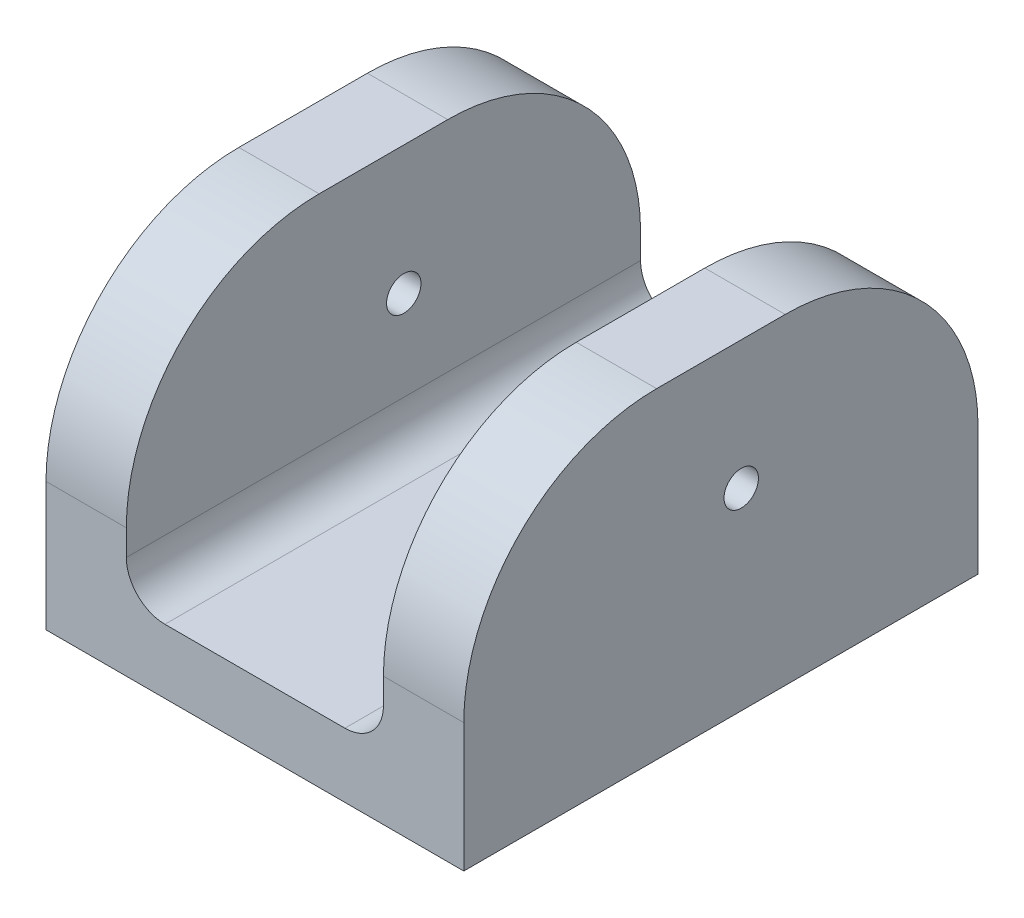
ISO-10303-21;
HEADER;
FILE_DESCRIPTION(('STEP AP214'),'2;1');
FILE_NAME('part.step','',(''),(''),'','','');
FILE_SCHEMA(('AUTOMOTIVE_DESIGN { 1 0 10303 214 1 1 1 1 }'));
ENDSEC;
DATA;
#1=APPLICATION_CONTEXT('core data for automotive mechanical design processes');
#2=APPLICATION_PROTOCOL_DEFINITION('international standard','automotive_design',2000,#1);
#3=PRODUCT_CONTEXT('',#1,'mechanical');
#4=PRODUCT('Part','Part','',(#3));
#5=PRODUCT_RELATED_PRODUCT_CATEGORY('part','',(#4));
#6=PRODUCT_DEFINITION_FORMATION('','',#4);
#7=PRODUCT_DEFINITION_CONTEXT('part definition',#1,'design');
#8=PRODUCT_DEFINITION('design','',#6,#7);
#9=PRODUCT_DEFINITION_SHAPE('','',#8);
#10=(LENGTH_UNIT() NAMED_UNIT(*) SI_UNIT(.MILLI.,.METRE.));
#11=(NAMED_UNIT(*) PLANE_ANGLE_UNIT() SI_UNIT($,.RADIAN.));
#12=(NAMED_UNIT(*) SI_UNIT($,.STERADIAN.) SOLID_ANGLE_UNIT());
#13=UNCERTAINTY_MEASURE_WITH_UNIT(LENGTH_MEASURE(1.E-05),#10,'distance_accuracy_value','');
#14=(GEOMETRIC_REPRESENTATION_CONTEXT(3) GLOBAL_UNCERTAINTY_ASSIGNED_CONTEXT((#13)) GLOBAL_UNIT_ASSIGNED_CONTEXT((#10,
#11,#12)) REPRESENTATION_CONTEXT('',''));
#15=CARTESIAN_POINT('',(0.,0.,0.));
#16=DIRECTION('',(0.,0.,1.));
#17=DIRECTION('',(1.,0.,0.));
#18=AXIS2_PLACEMENT_3D('',#15,#16,#17);
#19=CARTESIAN_POINT('',(20.6375,6.35000000000001,50.8));
#20=DIRECTION('',(-1.,0.,0.));
#21=DIRECTION('',(0.,0.,1.));
#22=AXIS2_PLACEMENT_3D('',#19,#20,#21);
#23=PLANE('',#22);
#24=CARTESIAN_POINT('',(20.6375,19.05,23.3910868668556));
#25=DIRECTION('',(1.,0.,0.));
#26=DIRECTION('',(0.,0.,-1.));
#27=AXIS2_PLACEMENT_3D('',#24,#25,#26);
#28=CIRCLE('',#27,1.69999999999999);
#29=CARTESIAN_POINT('',(20.6375,19.05,21.6910868668556));
#30=VERTEX_POINT('',#29);
#31=EDGE_CURVE('E392',#30,#30,#28,.T.);
#32=ORIENTED_EDGE('',*,*,#31,.F.);
#33=EDGE_LOOP('',(#32));
#34=FACE_BOUND('',#33,.T.);
#35=DIRECTION('',(0.,0.,-1.));
#36=VECTOR('',#35,1.);
#37=CARTESIAN_POINT('',(20.6375,31.75,50.8));
#38=LINE('',#37,#36);
#39=CARTESIAN_POINT('',(20.6375,31.75,31.75));
#40=VERTEX_POINT('',#39);
#41=CARTESIAN_POINT('',(20.6375,31.75,19.05));
#42=VERTEX_POINT('',#41);
#43=EDGE_CURVE('E230',#40,#42,#38,.T.);
#44=ORIENTED_EDGE('',*,*,#43,.F.);
#45=CARTESIAN_POINT('',(20.6375,12.7,31.75));
#46=DIRECTION('',(-1.,0.,0.));
#47=DIRECTION('',(0.,0.,1.));
#48=AXIS2_PLACEMENT_3D('',#45,#46,#47);
#49=CIRCLE('',#48,19.05);
#50=CARTESIAN_POINT('',(20.6375,12.7,50.8));
#51=VERTEX_POINT('',#50);
#52=EDGE_CURVE('E264',#40,#51,#49,.F.);
#53=ORIENTED_EDGE('',*,*,#52,.T.);
#54=DIRECTION('',(0.,1.,0.));
#55=VECTOR('',#54,1.);
#56=CARTESIAN_POINT('',(20.6375,0.,50.8));
#57=LINE('',#56,#55);
#58=CARTESIAN_POINT('',(20.6375,0.,50.8));
#59=VERTEX_POINT('',#58);
#60=EDGE_CURVE('E186',#59,#51,#57,.T.);
#61=ORIENTED_EDGE('',*,*,#60,.F.);
#62=DIRECTION('',(0.,0.,-1.));
#63=VECTOR('',#62,1.);
#64=CARTESIAN_POINT('',(20.6375,0.,50.8));
#65=LINE('',#64,#63);
#66=CARTESIAN_POINT('',(20.6375,0.,0.));
#67=VERTEX_POINT('',#66);
#68=EDGE_CURVE('E201',#59,#67,#65,.T.);
#69=ORIENTED_EDGE('',*,*,#68,.T.);
#70=DIRECTION('',(0.,1.,0.));
#71=VECTOR('',#70,1.);
#72=CARTESIAN_POINT('',(20.6375,6.35000000000001,0.));
#73=LINE('',#72,#71);
#74=CARTESIAN_POINT('',(20.6375,12.7,0.));
#75=VERTEX_POINT('',#74);
#76=EDGE_CURVE('E185',#67,#75,#73,.T.);
#77=ORIENTED_EDGE('',*,*,#76,.T.);
#78=CARTESIAN_POINT('',(20.6375,12.7,19.05));
#79=DIRECTION('',(-1.,0.,0.));
#80=DIRECTION('',(0.,0.,1.));
#81=AXIS2_PLACEMENT_3D('',#78,#79,#80);
#82=CIRCLE('',#81,19.05);
#83=EDGE_CURVE('E262',#75,#42,#82,.F.);
#84=ORIENTED_EDGE('',*,*,#83,.T.);
#85=EDGE_LOOP('',(#44,#53,#61,#69,#77,#84));
#86=FACE_BOUND('',#85,.T.);
#87=ADVANCED_FACE('F39',(#34,#86),#23,.F.);
#88=CARTESIAN_POINT('',(20.6375,31.75,50.8));
#89=DIRECTION('',(0.,-1.,0.));
#90=DIRECTION('',(1.,0.,0.));
#91=AXIS2_PLACEMENT_3D('',#88,#89,#90);
#92=PLANE('',#91);
#93=DIRECTION('',(0.,0.,-1.));
#94=VECTOR('',#93,1.);
#95=CARTESIAN_POINT('',(12.7,31.75,50.8));
#96=LINE('',#95,#94);
#97=CARTESIAN_POINT('',(12.7,31.75,31.75));
#98=VERTEX_POINT('',#97);
#99=CARTESIAN_POINT('',(12.7,31.75,19.05));
#100=VERTEX_POINT('',#99);
#101=EDGE_CURVE('E227',#98,#100,#96,.T.);
#102=ORIENTED_EDGE('',*,*,#101,.F.);
#103=DIRECTION('',(-1.,0.,0.));
#104=VECTOR('',#103,1.);
#105=CARTESIAN_POINT('',(20.6375,31.75,31.75));
#106=LINE('',#105,#104);
#107=EDGE_CURVE('E260',#98,#40,#106,.F.);
#108=ORIENTED_EDGE('',*,*,#107,.T.);
#109=ORIENTED_EDGE('',*,*,#43,.T.);
#110=DIRECTION('',(-1.,0.,0.));
#111=VECTOR('',#110,1.);
#112=CARTESIAN_POINT('',(20.6375,31.75,19.05));
#113=LINE('',#112,#111);
#114=EDGE_CURVE('E257',#42,#100,#113,.T.);
#115=ORIENTED_EDGE('',*,*,#114,.T.);
#116=EDGE_LOOP('',(#102,#108,#109,#115));
#117=FACE_BOUND('',#116,.T.);
#118=ADVANCED_FACE('F322',(#117),#92,.F.);
#119=CARTESIAN_POINT('',(12.7,31.75,50.8));
#120=DIRECTION('',(1.,0.,0.));
#121=DIRECTION('',(0.,0.,-1.));
#122=AXIS2_PLACEMENT_3D('',#119,#120,#121);
#123=PLANE('',#122);
#124=CARTESIAN_POINT('',(12.7,19.05,23.3910868668556));
#125=DIRECTION('',(1.,0.,0.));
#126=DIRECTION('',(0.,0.,-1.));
#127=AXIS2_PLACEMENT_3D('',#124,#125,#126);
#128=CIRCLE('',#127,1.69999999999999);
#129=CARTESIAN_POINT('',(12.7,19.05,21.6910868668556));
#130=VERTEX_POINT('',#129);
#131=EDGE_CURVE('E167',#130,#130,#128,.T.);
#132=ORIENTED_EDGE('',*,*,#131,.T.);
#133=EDGE_LOOP('',(#132));
#134=FACE_BOUND('',#133,.T.);
#135=DIRECTION('',(0.,-1.,0.));
#136=VECTOR('',#135,1.);
#137=CARTESIAN_POINT('',(12.7,31.75,0.));
#138=LINE('',#137,#136);
#139=CARTESIAN_POINT('',(12.7,12.7,0.));
#140=VERTEX_POINT('',#139);
#141=CARTESIAN_POINT('',(12.7,10.16,0.));
#142=VERTEX_POINT('',#141);
#143=EDGE_CURVE('E204',#140,#142,#138,.T.);
#144=ORIENTED_EDGE('',*,*,#143,.T.);
#145=DIRECTION('',(0.,0.,-1.));
#146=VECTOR('',#145,1.);
#147=CARTESIAN_POINT('',(12.7,10.16,50.8));
#148=LINE('',#147,#146);
#149=CARTESIAN_POINT('',(12.7,10.16,50.8));
#150=VERTEX_POINT('',#149);
#151=EDGE_CURVE('E276',#142,#150,#148,.F.);
#152=ORIENTED_EDGE('',*,*,#151,.T.);
#153=DIRECTION('',(0.,-1.,0.));
#154=VECTOR('',#153,1.);
#155=CARTESIAN_POINT('',(12.7,31.75,50.8));
#156=LINE('',#155,#154);
#157=CARTESIAN_POINT('',(12.7,12.7,50.8));
#158=VERTEX_POINT('',#157);
#159=EDGE_CURVE('E189',#158,#150,#156,.T.);
#160=ORIENTED_EDGE('',*,*,#159,.F.);
#161=CARTESIAN_POINT('',(12.7,12.7,31.75));
#162=DIRECTION('',(1.,0.,0.));
#163=DIRECTION('',(0.,0.,-1.));
#164=AXIS2_PLACEMENT_3D('',#161,#162,#163);
#165=CIRCLE('',#164,19.05);
#166=EDGE_CURVE('E255',#158,#98,#165,.F.);
#167=ORIENTED_EDGE('',*,*,#166,.T.);
#168=ORIENTED_EDGE('',*,*,#101,.T.);
#169=CARTESIAN_POINT('',(12.7,12.7,19.05));
#170=DIRECTION('',(1.,0.,0.));
#171=DIRECTION('',(0.,0.,-1.));
#172=AXIS2_PLACEMENT_3D('',#169,#170,#171);
#173=CIRCLE('',#172,19.05);
#174=EDGE_CURVE('E253',#100,#140,#173,.F.);
#175=ORIENTED_EDGE('',*,*,#174,.T.);
#176=EDGE_LOOP('',(#144,#152,#160,#167,#168,#175));
#177=FACE_BOUND('',#176,.T.);
#178=ADVANCED_FACE('F320',(#134,#177),#123,.F.);
#179=CARTESIAN_POINT('',(12.7,6.35000000000001,50.8));
#180=DIRECTION('',(0.,-1.,0.));
#181=DIRECTION('',(1.,0.,0.));
#182=AXIS2_PLACEMENT_3D('',#179,#180,#181);
#183=PLANE('',#182);
#184=DIRECTION('',(-1.,0.,0.));
#185=VECTOR('',#184,1.);
#186=CARTESIAN_POINT('',(12.7,6.35000000000001,50.8));
#187=LINE('',#186,#185);
#188=CARTESIAN_POINT('',(8.89,6.35000000000001,50.8));
#189=VERTEX_POINT('',#188);
#190=CARTESIAN_POINT('',(-8.89,6.35,50.8));
#191=VERTEX_POINT('',#190);
#192=EDGE_CURVE('E193',#189,#191,#187,.T.);
#193=ORIENTED_EDGE('',*,*,#192,.F.);
#194=DIRECTION('',(0.,0.,-1.));
#195=VECTOR('',#194,1.);
#196=CARTESIAN_POINT('',(8.89,6.35000000000001,0.));
#197=LINE('',#196,#195);
#198=CARTESIAN_POINT('',(8.89,6.35000000000001,0.));
#199=VERTEX_POINT('',#198);
#200=EDGE_CURVE('E273',#189,#199,#197,.T.);
#201=ORIENTED_EDGE('',*,*,#200,.T.);
#202=DIRECTION('',(-1.,0.,0.));
#203=VECTOR('',#202,1.);
#204=CARTESIAN_POINT('',(12.7,6.35000000000001,0.));
#205=LINE('',#204,#203);
#206=CARTESIAN_POINT('',(-8.89,6.35,0.));
#207=VERTEX_POINT('',#206);
#208=EDGE_CURVE('E207',#199,#207,#205,.T.);
#209=ORIENTED_EDGE('',*,*,#208,.T.);
#210=DIRECTION('',(0.,0.,-1.));
#211=VECTOR('',#210,1.);
#212=CARTESIAN_POINT('',(-8.89,6.35,50.8));
#213=LINE('',#212,#211);
#214=EDGE_CURVE('E271',#207,#191,#213,.F.);
#215=ORIENTED_EDGE('',*,*,#214,.T.);
#216=EDGE_LOOP('',(#193,#201,#209,#215));
#217=FACE_BOUND('',#216,.T.);
#218=ADVANCED_FACE('F291',(#217),#183,.F.);
#219=CARTESIAN_POINT('',(-12.7,31.75,50.8));
#220=DIRECTION('',(-1.,0.,0.));
#221=DIRECTION('',(0.,-1.,0.));
#222=AXIS2_PLACEMENT_3D('',#219,#220,#221);
#223=PLANE('',#222);
#224=CARTESIAN_POINT('',(-12.7,19.05,23.3910868668556));
#225=DIRECTION('',(-1.,0.,0.));
#226=DIRECTION('',(0.,-1.,0.));
#227=AXIS2_PLACEMENT_3D('',#224,#225,#226);
#228=CIRCLE('',#227,1.69999999999999);
#229=CARTESIAN_POINT('',(-12.7,17.35,23.3910868668556));
#230=VERTEX_POINT('',#229);
#231=EDGE_CURVE('E43',#230,#230,#228,.T.);
#232=ORIENTED_EDGE('',*,*,#231,.T.);
#233=EDGE_LOOP('',(#232));
#234=FACE_BOUND('',#233,.T.);
#235=DIRECTION('',(0.,1.,0.));
#236=VECTOR('',#235,1.);
#237=CARTESIAN_POINT('',(-12.7,31.75,50.8));
#238=LINE('',#237,#236);
#239=CARTESIAN_POINT('',(-12.7,10.16,50.8));
#240=VERTEX_POINT('',#239);
#241=CARTESIAN_POINT('',(-12.7,12.7,50.8));
#242=VERTEX_POINT('',#241);
#243=EDGE_CURVE('E195',#240,#242,#238,.T.);
#244=ORIENTED_EDGE('',*,*,#243,.F.);
#245=DIRECTION('',(0.,0.,-1.));
#246=VECTOR('',#245,1.);
#247=CARTESIAN_POINT('',(-12.7,10.16,0.));
#248=LINE('',#247,#246);
#249=CARTESIAN_POINT('',(-12.7,10.16,0.));
#250=VERTEX_POINT('',#249);
#251=EDGE_CURVE('E278',#240,#250,#248,.T.);
#252=ORIENTED_EDGE('',*,*,#251,.T.);
#253=DIRECTION('',(0.,1.,0.));
#254=VECTOR('',#253,1.);
#255=CARTESIAN_POINT('',(-12.7,31.75,0.));
#256=LINE('',#255,#254);
#257=CARTESIAN_POINT('',(-12.7,12.7,0.));
#258=VERTEX_POINT('',#257);
#259=EDGE_CURVE('E210',#250,#258,#256,.T.);
#260=ORIENTED_EDGE('',*,*,#259,.T.);
#261=CARTESIAN_POINT('',(-12.7,12.7,19.05));
#262=DIRECTION('',(-1.,0.,0.));
#263=DIRECTION('',(0.,-1.,0.));
#264=AXIS2_PLACEMENT_3D('',#261,#262,#263);
#265=CIRCLE('',#264,19.05);
#266=CARTESIAN_POINT('',(-12.7,31.75,19.05));
#267=VERTEX_POINT('',#266);
#268=EDGE_CURVE('E248',#258,#267,#265,.F.);
#269=ORIENTED_EDGE('',*,*,#268,.T.);
#270=DIRECTION('',(0.,0.,-1.));
#271=VECTOR('',#270,1.);
#272=CARTESIAN_POINT('',(-12.7,31.75,50.8));
#273=LINE('',#272,#271);
#274=CARTESIAN_POINT('',(-12.7,31.75,31.75));
#275=VERTEX_POINT('',#274);
#276=EDGE_CURVE('E224',#275,#267,#273,.T.);
#277=ORIENTED_EDGE('',*,*,#276,.F.);
#278=CARTESIAN_POINT('',(-12.7,12.7,31.75));
#279=DIRECTION('',(-1.,0.,0.));
#280=DIRECTION('',(0.,-1.,0.));
#281=AXIS2_PLACEMENT_3D('',#278,#279,#280);
#282=CIRCLE('',#281,19.05);
#283=EDGE_CURVE('E250',#275,#242,#282,.F.);
#284=ORIENTED_EDGE('',*,*,#283,.T.);
#285=EDGE_LOOP('',(#244,#252,#260,#269,#277,#284));
#286=FACE_BOUND('',#285,.T.);
#287=ADVANCED_FACE('F294',(#234,#286),#223,.F.);
#288=CARTESIAN_POINT('',(-20.6375,31.75,50.8));
#289=DIRECTION('',(0.,-1.,0.));
#290=DIRECTION('',(0.,0.,-1.));
#291=AXIS2_PLACEMENT_3D('',#288,#289,#290);
#292=PLANE('',#291);
#293=DIRECTION('',(0.,0.,-1.));
#294=VECTOR('',#293,1.);
#295=CARTESIAN_POINT('',(-20.6375,31.75,50.8));
#296=LINE('',#295,#294);
#297=CARTESIAN_POINT('',(-20.6375,31.75,31.75));
#298=VERTEX_POINT('',#297);
#299=CARTESIAN_POINT('',(-20.6375,31.75,19.05));
#300=VERTEX_POINT('',#299);
#301=EDGE_CURVE('E221',#298,#300,#296,.T.);
#302=ORIENTED_EDGE('',*,*,#301,.F.);
#303=DIRECTION('',(-1.,0.,0.));
#304=VECTOR('',#303,1.);
#305=CARTESIAN_POINT('',(-12.7,31.75,31.75));
#306=LINE('',#305,#304);
#307=EDGE_CURVE('E246',#298,#275,#306,.F.);
#308=ORIENTED_EDGE('',*,*,#307,.T.);
#309=ORIENTED_EDGE('',*,*,#276,.T.);
#310=DIRECTION('',(-1.,0.,0.));
#311=VECTOR('',#310,1.);
#312=CARTESIAN_POINT('',(-20.6375,31.75,19.05));
#313=LINE('',#312,#311);
#314=EDGE_CURVE('E243',#267,#300,#313,.T.);
#315=ORIENTED_EDGE('',*,*,#314,.T.);
#316=EDGE_LOOP('',(#302,#308,#309,#315));
#317=FACE_BOUND('',#316,.T.);
#318=ADVANCED_FACE('F365',(#317),#292,.F.);
#319=CARTESIAN_POINT('',(-20.6375,0.,50.8));
#320=DIRECTION('',(1.,0.,0.));
#321=DIRECTION('',(0.,0.,-1.));
#322=AXIS2_PLACEMENT_3D('',#319,#320,#321);
#323=PLANE('',#322);
#324=CARTESIAN_POINT('',(-20.6375,19.05,23.3910868668556));
#325=DIRECTION('',(1.,0.,0.));
#326=DIRECTION('',(0.,0.,-1.));
#327=AXIS2_PLACEMENT_3D('',#324,#325,#326);
#328=CIRCLE('',#327,1.69999999999999);
#329=CARTESIAN_POINT('',(-20.6375,19.05,21.6910868668556));
#330=VERTEX_POINT('',#329);
#331=EDGE_CURVE('E388',#330,#330,#328,.T.);
#332=ORIENTED_EDGE('',*,*,#331,.T.);
#333=EDGE_LOOP('',(#332));
#334=FACE_BOUND('',#333,.T.);
#335=DIRECTION('',(0.,-1.,0.));
#336=VECTOR('',#335,1.);
#337=CARTESIAN_POINT('',(-20.6375,6.35000000000001,50.8));
#338=LINE('',#337,#336);
#339=CARTESIAN_POINT('',(-20.6375,12.7,50.8));
#340=VERTEX_POINT('',#339);
#341=CARTESIAN_POINT('',(-20.6375,0.,50.8));
#342=VERTEX_POINT('',#341);
#343=EDGE_CURVE('E197',#340,#342,#338,.T.);
#344=ORIENTED_EDGE('',*,*,#343,.F.);
#345=CARTESIAN_POINT('',(-20.6375,12.7,31.75));
#346=DIRECTION('',(1.,0.,0.));
#347=DIRECTION('',(0.,0.,-1.));
#348=AXIS2_PLACEMENT_3D('',#345,#346,#347);
#349=CIRCLE('',#348,19.05);
#350=EDGE_CURVE('E241',#340,#298,#349,.F.);
#351=ORIENTED_EDGE('',*,*,#350,.T.);
#352=ORIENTED_EDGE('',*,*,#301,.T.);
#353=CARTESIAN_POINT('',(-20.6375,12.7,19.05));
#354=DIRECTION('',(1.,0.,0.));
#355=DIRECTION('',(0.,0.,-1.));
#356=AXIS2_PLACEMENT_3D('',#353,#354,#355);
#357=CIRCLE('',#356,19.05);
#358=CARTESIAN_POINT('',(-20.6375,12.7,0.));
#359=VERTEX_POINT('',#358);
#360=EDGE_CURVE('E239',#300,#359,#357,.F.);
#361=ORIENTED_EDGE('',*,*,#360,.T.);
#362=DIRECTION('',(0.,-1.,0.));
#363=VECTOR('',#362,1.);
#364=CARTESIAN_POINT('',(-20.6375,0.,0.));
#365=LINE('',#364,#363);
#366=CARTESIAN_POINT('',(-20.6375,0.,0.));
#367=VERTEX_POINT('',#366);
#368=EDGE_CURVE('E212',#359,#367,#365,.T.);
#369=ORIENTED_EDGE('',*,*,#368,.T.);
#370=DIRECTION('',(0.,0.,-1.));
#371=VECTOR('',#370,1.);
#372=CARTESIAN_POINT('',(-20.6375,0.,50.8));
#373=LINE('',#372,#371);
#374=EDGE_CURVE('E218',#342,#367,#373,.T.);
#375=ORIENTED_EDGE('',*,*,#374,.F.);
#376=EDGE_LOOP('',(#344,#351,#352,#361,#369,#375));
#377=FACE_BOUND('',#376,.T.);
#378=ADVANCED_FACE('F303',(#334,#377),#323,.F.);
#379=CARTESIAN_POINT('',(-20.6375,0.,50.8));
#380=DIRECTION('',(0.,1.,0.));
#381=DIRECTION('',(-1.,0.,0.));
#382=AXIS2_PLACEMENT_3D('',#379,#380,#381);
#383=PLANE('',#382);
#384=CARTESIAN_POINT('',(16.66875,0.,3.96875));
#385=DIRECTION('',(0.,-1.,0.));
#386=DIRECTION('',(0.,0.,-1.));
#387=AXIS2_PLACEMENT_3D('',#384,#385,#386);
#388=CIRCLE('',#387,2.5527);
#389=CARTESIAN_POINT('',(16.66875,0.,1.41605000000001));
#390=VERTEX_POINT('',#389);
#391=EDGE_CURVE('E161',#390,#390,#388,.T.);
#392=ORIENTED_EDGE('',*,*,#391,.F.);
#393=EDGE_LOOP('',(#392));
#394=FACE_BOUND('',#393,.T.);
#395=CARTESIAN_POINT('',(-16.66875,0.,3.96875));
#396=DIRECTION('',(0.,-1.,0.));
#397=DIRECTION('',(0.,0.,-1.));
#398=AXIS2_PLACEMENT_3D('',#395,#396,#397);
#399=CIRCLE('',#398,2.5527);
#400=CARTESIAN_POINT('',(-16.66875,0.,1.41605));
#401=VERTEX_POINT('',#400);
#402=EDGE_CURVE('E160',#401,#401,#399,.T.);
#403=ORIENTED_EDGE('',*,*,#402,.F.);
#404=EDGE_LOOP('',(#403));
#405=FACE_BOUND('',#404,.T.);
#406=CARTESIAN_POINT('',(-16.66875,0.,46.83125));
#407=DIRECTION('',(0.,-1.,0.));
#408=DIRECTION('',(0.,0.,-1.));
#409=AXIS2_PLACEMENT_3D('',#406,#407,#408);
#410=CIRCLE('',#409,2.5527);
#411=CARTESIAN_POINT('',(-16.66875,0.,44.27855));
#412=VERTEX_POINT('',#411);
#413=EDGE_CURVE('E173',#412,#412,#410,.T.);
#414=ORIENTED_EDGE('',*,*,#413,.F.);
#415=EDGE_LOOP('',(#414));
#416=FACE_BOUND('',#415,.T.);
#417=CARTESIAN_POINT('',(16.66875,0.,46.83125));
#418=DIRECTION('',(0.,-1.,0.));
#419=DIRECTION('',(0.,0.,-1.));
#420=AXIS2_PLACEMENT_3D('',#417,#418,#419);
#421=CIRCLE('',#420,2.5527);
#422=CARTESIAN_POINT('',(16.66875,0.,44.27855));
#423=VERTEX_POINT('',#422);
#424=EDGE_CURVE('E179',#423,#423,#421,.T.);
#425=ORIENTED_EDGE('',*,*,#424,.F.);
#426=EDGE_LOOP('',(#425));
#427=FACE_BOUND('',#426,.T.);
#428=DIRECTION('',(1.,0.,0.));
#429=VECTOR('',#428,1.);
#430=CARTESIAN_POINT('',(-20.6375,0.,0.));
#431=LINE('',#430,#429);
#432=EDGE_CURVE('E190',#367,#67,#431,.T.);
#433=ORIENTED_EDGE('',*,*,#432,.T.);
#434=ORIENTED_EDGE('',*,*,#68,.F.);
#435=DIRECTION('',(1.,0.,0.));
#436=VECTOR('',#435,1.);
#437=CARTESIAN_POINT('',(-20.6375,0.,50.8));
#438=LINE('',#437,#436);
#439=EDGE_CURVE('E199',#342,#59,#438,.T.);
#440=ORIENTED_EDGE('',*,*,#439,.F.);
#441=ORIENTED_EDGE('',*,*,#374,.T.);
#442=EDGE_LOOP('',(#433,#434,#440,#441));
#443=FACE_BOUND('',#442,.T.);
#444=ADVANCED_FACE('F309',(#394,#405,#416,#427,#443),#383,.F.);
#445=CARTESIAN_POINT('',(0.,0.,50.8));
#446=DIRECTION('',(0.,0.,1.));
#447=DIRECTION('',(1.,0.,0.));
#448=AXIS2_PLACEMENT_3D('',#445,#446,#447);
#449=PLANE('',#448);
#450=ORIENTED_EDGE('',*,*,#192,.T.);
#451=CARTESIAN_POINT('',(-8.89,10.16,50.8));
#452=DIRECTION('',(0.,0.,1.));
#453=DIRECTION('',(1.,0.,0.));
#454=AXIS2_PLACEMENT_3D('',#451,#452,#453);
#455=CIRCLE('',#454,3.81);
#456=EDGE_CURVE('E11',#191,#240,#455,.F.);
#457=ORIENTED_EDGE('',*,*,#456,.T.);
#458=ORIENTED_EDGE('',*,*,#243,.T.);
#459=DIRECTION('',(-1.,0.,0.));
#460=VECTOR('',#459,1.);
#461=CARTESIAN_POINT('',(-20.6375,12.7,50.8));
#462=LINE('',#461,#460);
#463=EDGE_CURVE('E236',#242,#340,#462,.T.);
#464=ORIENTED_EDGE('',*,*,#463,.T.);
#465=ORIENTED_EDGE('',*,*,#343,.T.);
#466=ORIENTED_EDGE('',*,*,#439,.T.);
#467=ORIENTED_EDGE('',*,*,#60,.T.);
#468=DIRECTION('',(-1.,0.,0.));
#469=VECTOR('',#468,1.);
#470=CARTESIAN_POINT('',(12.7,12.7,50.8));
#471=LINE('',#470,#469);
#472=EDGE_CURVE('E233',#51,#158,#471,.T.);
#473=ORIENTED_EDGE('',*,*,#472,.T.);
#474=ORIENTED_EDGE('',*,*,#159,.T.);
#475=CARTESIAN_POINT('',(8.89,10.16,50.8));
#476=DIRECTION('',(0.,0.,1.));
#477=DIRECTION('',(1.,0.,0.));
#478=AXIS2_PLACEMENT_3D('',#475,#476,#477);
#479=CIRCLE('',#478,3.81);
#480=EDGE_CURVE('E282',#150,#189,#479,.F.);
#481=ORIENTED_EDGE('',*,*,#480,.T.);
#482=EDGE_LOOP('',(#450,#457,#458,#464,#465,#466,#467,#473,#474,#481));
#483=FACE_BOUND('',#482,.T.);
#484=ADVANCED_FACE('F298',(#483),#449,.T.);
#485=CARTESIAN_POINT('',(0.,0.,0.));
#486=DIRECTION('',(0.,0.,1.));
#487=DIRECTION('',(1.,0.,0.));
#488=AXIS2_PLACEMENT_3D('',#485,#486,#487);
#489=PLANE('',#488);
#490=ORIENTED_EDGE('',*,*,#368,.F.);
#491=DIRECTION('',(-1.,0.,0.));
#492=VECTOR('',#491,1.);
#493=CARTESIAN_POINT('',(0.,12.7,0.));
#494=LINE('',#493,#492);
#495=EDGE_CURVE('E268',#359,#258,#494,.F.);
#496=ORIENTED_EDGE('',*,*,#495,.T.);
#497=ORIENTED_EDGE('',*,*,#259,.F.);
#498=CARTESIAN_POINT('',(-8.89,10.16,0.));
#499=DIRECTION('',(0.,0.,1.));
#500=DIRECTION('',(1.,0.,0.));
#501=AXIS2_PLACEMENT_3D('',#498,#499,#500);
#502=CIRCLE('',#501,3.81);
#503=EDGE_CURVE('E48',#250,#207,#502,.T.);
#504=ORIENTED_EDGE('',*,*,#503,.T.);
#505=ORIENTED_EDGE('',*,*,#208,.F.);
#506=CARTESIAN_POINT('',(8.89,10.16,0.));
#507=DIRECTION('',(0.,0.,1.));
#508=DIRECTION('',(1.,0.,0.));
#509=AXIS2_PLACEMENT_3D('',#506,#507,#508);
#510=CIRCLE('',#509,3.81);
#511=EDGE_CURVE('E280',#199,#142,#510,.T.);
#512=ORIENTED_EDGE('',*,*,#511,.T.);
#513=ORIENTED_EDGE('',*,*,#143,.F.);
#514=DIRECTION('',(-1.,0.,0.));
#515=VECTOR('',#514,1.);
#516=CARTESIAN_POINT('',(0.,12.7,0.));
#517=LINE('',#516,#515);
#518=EDGE_CURVE('E266',#140,#75,#517,.F.);
#519=ORIENTED_EDGE('',*,*,#518,.T.);
#520=ORIENTED_EDGE('',*,*,#76,.F.);
#521=ORIENTED_EDGE('',*,*,#432,.F.);
#522=EDGE_LOOP('',(#490,#496,#497,#504,#505,#512,#513,#519,#520,#521));
#523=FACE_BOUND('',#522,.T.);
#524=ADVANCED_FACE('F288',(#523),#489,.F.);
#525=CARTESIAN_POINT('',(0.,12.7,31.75));
#526=DIRECTION('',(1.,0.,0.));
#527=DIRECTION('',(0.,0.,-1.));
#528=AXIS2_PLACEMENT_3D('',#525,#526,#527);
#529=CYLINDRICAL_SURFACE('',#528,19.05);
#530=ORIENTED_EDGE('',*,*,#283,.F.);
#531=ORIENTED_EDGE('',*,*,#307,.F.);
#532=ORIENTED_EDGE('',*,*,#350,.F.);
#533=ORIENTED_EDGE('',*,*,#463,.F.);
#534=EDGE_LOOP('',(#530,#531,#532,#533));
#535=FACE_BOUND('',#534,.T.);
#536=ADVANCED_FACE('F352',(#535),#529,.T.);
#537=CARTESIAN_POINT('',(0.,12.7,31.75));
#538=DIRECTION('',(1.,0.,0.));
#539=DIRECTION('',(0.,1.,0.));
#540=AXIS2_PLACEMENT_3D('',#537,#538,#539);
#541=CYLINDRICAL_SURFACE('',#540,19.05);
#542=ORIENTED_EDGE('',*,*,#52,.F.);
#543=ORIENTED_EDGE('',*,*,#107,.F.);
#544=ORIENTED_EDGE('',*,*,#166,.F.);
#545=ORIENTED_EDGE('',*,*,#472,.F.);
#546=EDGE_LOOP('',(#542,#543,#544,#545));
#547=FACE_BOUND('',#546,.T.);
#548=ADVANCED_FACE('F316',(#547),#541,.T.);
#549=CARTESIAN_POINT('',(-20.6375,12.7,19.05));
#550=DIRECTION('',(-1.,0.,0.));
#551=DIRECTION('',(0.,0.,1.));
#552=AXIS2_PLACEMENT_3D('',#549,#550,#551);
#553=CYLINDRICAL_SURFACE('',#552,19.05);
#554=ORIENTED_EDGE('',*,*,#268,.F.);
#555=ORIENTED_EDGE('',*,*,#495,.F.);
#556=ORIENTED_EDGE('',*,*,#360,.F.);
#557=ORIENTED_EDGE('',*,*,#314,.F.);
#558=EDGE_LOOP('',(#554,#555,#556,#557));
#559=FACE_BOUND('',#558,.T.);
#560=ADVANCED_FACE('F340',(#559),#553,.T.);
#561=CARTESIAN_POINT('',(20.6375,12.7,19.05));
#562=DIRECTION('',(-1.,0.,0.));
#563=DIRECTION('',(0.,-1.,0.));
#564=AXIS2_PLACEMENT_3D('',#561,#562,#563);
#565=CYLINDRICAL_SURFACE('',#564,19.05);
#566=ORIENTED_EDGE('',*,*,#83,.F.);
#567=ORIENTED_EDGE('',*,*,#518,.F.);
#568=ORIENTED_EDGE('',*,*,#174,.F.);
#569=ORIENTED_EDGE('',*,*,#114,.F.);
#570=EDGE_LOOP('',(#566,#567,#568,#569));
#571=FACE_BOUND('',#570,.T.);
#572=ADVANCED_FACE('F327',(#571),#565,.T.);
#573=CARTESIAN_POINT('',(8.89,10.16,50.8));
#574=DIRECTION('',(0.,0.,1.));
#575=DIRECTION('',(1.,0.,0.));
#576=AXIS2_PLACEMENT_3D('',#573,#574,#575);
#577=CYLINDRICAL_SURFACE('',#576,3.81);
#578=ORIENTED_EDGE('',*,*,#480,.F.);
#579=ORIENTED_EDGE('',*,*,#151,.F.);
#580=ORIENTED_EDGE('',*,*,#511,.F.);
#581=ORIENTED_EDGE('',*,*,#200,.F.);
#582=EDGE_LOOP('',(#578,#579,#580,#581));
#583=FACE_BOUND('',#582,.T.);
#584=ADVANCED_FACE('F333',(#583),#577,.F.);
#585=CARTESIAN_POINT('',(-8.89,10.16,50.8));
#586=DIRECTION('',(0.,0.,1.));
#587=DIRECTION('',(1.,0.,0.));
#588=AXIS2_PLACEMENT_3D('',#585,#586,#587);
#589=CYLINDRICAL_SURFACE('',#588,3.81);
#590=ORIENTED_EDGE('',*,*,#456,.F.);
#591=ORIENTED_EDGE('',*,*,#214,.F.);
#592=ORIENTED_EDGE('',*,*,#503,.F.);
#593=ORIENTED_EDGE('',*,*,#251,.F.);
#594=EDGE_LOOP('',(#590,#591,#592,#593));
#595=FACE_BOUND('',#594,.T.);
#596=ADVANCED_FACE('F41',(#595),#589,.F.);
#597=CARTESIAN_POINT('',(16.66875,19.05,46.83125));
#598=DIRECTION('',(0.,-1.,0.));
#599=DIRECTION('',(0.,0.,-1.));
#600=AXIS2_PLACEMENT_3D('',#597,#598,#599);
#601=CONICAL_SURFACE('',#600,2.55269999999999,1.02974425867665);
#602=CARTESIAN_POINT('',(16.66875,20.5838169021917,46.83125));
#603=VERTEX_POINT('',#602);
#604=VERTEX_LOOP('',#603);
#605=FACE_BOUND('',#604,.T.);
#606=CARTESIAN_POINT('',(16.66875,19.05,46.83125));
#607=DIRECTION('',(0.,-1.,0.));
#608=DIRECTION('',(0.,0.,-1.));
#609=AXIS2_PLACEMENT_3D('',#606,#607,#608);
#610=CIRCLE('',#609,2.55269999999999);
#611=CARTESIAN_POINT('',(16.66875,19.05,44.27855));
#612=VERTEX_POINT('',#611);
#613=EDGE_CURVE('E182',#612,#612,#610,.T.);
#614=ORIENTED_EDGE('',*,*,#613,.T.);
#615=EDGE_LOOP('',(#614));
#616=FACE_BOUND('',#615,.T.);
#617=ADVANCED_FACE('F339',(#605,#616),#601,.F.);
#618=CARTESIAN_POINT('',(16.66875,0.,46.83125));
#619=DIRECTION('',(0.,-1.,0.));
#620=DIRECTION('',(0.,0.,-1.));
#621=AXIS2_PLACEMENT_3D('',#618,#619,#620);
#622=CYLINDRICAL_SURFACE('',#621,2.5527);
#623=ORIENTED_EDGE('',*,*,#613,.F.);
#624=EDGE_LOOP('',(#623));
#625=FACE_BOUND('',#624,.T.);
#626=ORIENTED_EDGE('',*,*,#424,.T.);
#627=EDGE_LOOP('',(#626));
#628=FACE_BOUND('',#627,.T.);
#629=ADVANCED_FACE('F420',(#625,#628),#622,.F.);
#630=CARTESIAN_POINT('',(-16.66875,19.05,46.83125));
#631=DIRECTION('',(0.,-1.,0.));
#632=DIRECTION('',(0.,0.,-1.));
#633=AXIS2_PLACEMENT_3D('',#630,#631,#632);
#634=CONICAL_SURFACE('',#633,2.5527,1.02974425867665);
#635=CARTESIAN_POINT('',(-16.66875,20.5838169021916,46.83125));
#636=VERTEX_POINT('',#635);
#637=VERTEX_LOOP('',#636);
#638=FACE_BOUND('',#637,.T.);
#639=CARTESIAN_POINT('',(-16.66875,19.05,46.83125));
#640=DIRECTION('',(0.,-1.,0.));
#641=DIRECTION('',(0.,0.,-1.));
#642=AXIS2_PLACEMENT_3D('',#639,#640,#641);
#643=CIRCLE('',#642,2.5527);
#644=CARTESIAN_POINT('',(-16.66875,19.05,44.27855));
#645=VERTEX_POINT('',#644);
#646=EDGE_CURVE('E176',#645,#645,#643,.T.);
#647=ORIENTED_EDGE('',*,*,#646,.T.);
#648=EDGE_LOOP('',(#647));
#649=FACE_BOUND('',#648,.T.);
#650=ADVANCED_FACE('F416',(#638,#649),#634,.F.);
#651=CARTESIAN_POINT('',(-16.66875,0.,46.83125));
#652=DIRECTION('',(0.,-1.,0.));
#653=DIRECTION('',(0.,0.,-1.));
#654=AXIS2_PLACEMENT_3D('',#651,#652,#653);
#655=CYLINDRICAL_SURFACE('',#654,2.5527);
#656=ORIENTED_EDGE('',*,*,#646,.F.);
#657=EDGE_LOOP('',(#656));
#658=FACE_BOUND('',#657,.T.);
#659=ORIENTED_EDGE('',*,*,#413,.T.);
#660=EDGE_LOOP('',(#659));
#661=FACE_BOUND('',#660,.T.);
#662=ADVANCED_FACE('F412',(#658,#661),#655,.F.);
#663=CARTESIAN_POINT('',(-16.66875,19.05,3.96875));
#664=DIRECTION('',(0.,-1.,0.));
#665=DIRECTION('',(0.,0.,-1.));
#666=AXIS2_PLACEMENT_3D('',#663,#664,#665);
#667=CONICAL_SURFACE('',#666,2.5527,1.02974425867665);
#668=CARTESIAN_POINT('',(-16.66875,20.5838169021916,3.96875));
#669=VERTEX_POINT('',#668);
#670=VERTEX_LOOP('',#669);
#671=FACE_BOUND('',#670,.T.);
#672=CARTESIAN_POINT('',(-16.66875,19.05,3.96875));
#673=DIRECTION('',(0.,-1.,0.));
#674=DIRECTION('',(0.,0.,-1.));
#675=AXIS2_PLACEMENT_3D('',#672,#673,#674);
#676=CIRCLE('',#675,2.5527);
#677=CARTESIAN_POINT('',(-16.66875,19.05,1.41605));
#678=VERTEX_POINT('',#677);
#679=EDGE_CURVE('E164',#678,#678,#676,.T.);
#680=ORIENTED_EDGE('',*,*,#679,.T.);
#681=EDGE_LOOP('',(#680));
#682=FACE_BOUND('',#681,.T.);
#683=ADVANCED_FACE('F408',(#671,#682),#667,.F.);
#684=CARTESIAN_POINT('',(-16.66875,0.,3.96875));
#685=DIRECTION('',(0.,-1.,0.));
#686=DIRECTION('',(0.,0.,-1.));
#687=AXIS2_PLACEMENT_3D('',#684,#685,#686);
#688=CYLINDRICAL_SURFACE('',#687,2.5527);
#689=ORIENTED_EDGE('',*,*,#679,.F.);
#690=EDGE_LOOP('',(#689));
#691=FACE_BOUND('',#690,.T.);
#692=ORIENTED_EDGE('',*,*,#402,.T.);
#693=EDGE_LOOP('',(#692));
#694=FACE_BOUND('',#693,.T.);
#695=ADVANCED_FACE('F154',(#691,#694),#688,.F.);
#696=CARTESIAN_POINT('',(16.66875,19.05,3.96875));
#697=DIRECTION('',(0.,-1.,0.));
#698=DIRECTION('',(0.,0.,-1.));
#699=AXIS2_PLACEMENT_3D('',#696,#697,#698);
#700=CONICAL_SURFACE('',#699,2.55269999999999,1.02974425867665);
#701=CARTESIAN_POINT('',(16.66875,20.5838169021917,3.96875));
#702=VERTEX_POINT('',#701);
#703=VERTEX_LOOP('',#702);
#704=FACE_BOUND('',#703,.T.);
#705=CARTESIAN_POINT('',(16.66875,19.05,3.96875));
#706=DIRECTION('',(0.,-1.,0.));
#707=DIRECTION('',(0.,0.,-1.));
#708=AXIS2_PLACEMENT_3D('',#705,#706,#707);
#709=CIRCLE('',#708,2.55269999999999);
#710=CARTESIAN_POINT('',(16.66875,19.05,1.41605000000001));
#711=VERTEX_POINT('',#710);
#712=EDGE_CURVE('E158',#711,#711,#709,.T.);
#713=ORIENTED_EDGE('',*,*,#712,.T.);
#714=EDGE_LOOP('',(#713));
#715=FACE_BOUND('',#714,.T.);
#716=ADVANCED_FACE('F150',(#704,#715),#700,.F.);
#717=CARTESIAN_POINT('',(16.66875,0.,3.96875));
#718=DIRECTION('',(0.,-1.,0.));
#719=DIRECTION('',(0.,0.,-1.));
#720=AXIS2_PLACEMENT_3D('',#717,#718,#719);
#721=CYLINDRICAL_SURFACE('',#720,2.5527);
#722=ORIENTED_EDGE('',*,*,#712,.F.);
#723=EDGE_LOOP('',(#722));
#724=FACE_BOUND('',#723,.T.);
#725=ORIENTED_EDGE('',*,*,#391,.T.);
#726=EDGE_LOOP('',(#725));
#727=FACE_BOUND('',#726,.T.);
#728=ADVANCED_FACE('F153',(#724,#727),#721,.F.);
#729=CARTESIAN_POINT('',(20.6375,19.05,23.3910868668556));
#730=DIRECTION('',(1.,0.,0.));
#731=DIRECTION('',(0.,0.,-1.));
#732=AXIS2_PLACEMENT_3D('',#729,#730,#731);
#733=CYLINDRICAL_SURFACE('',#732,1.69999999999999);
#734=ORIENTED_EDGE('',*,*,#331,.F.);
#735=EDGE_LOOP('',(#734));
#736=FACE_BOUND('',#735,.T.);
#737=ORIENTED_EDGE('',*,*,#231,.F.);
#738=EDGE_LOOP('',(#737));
#739=FACE_BOUND('',#738,.T.);
#740=ADVANCED_FACE('F397',(#736,#739),#733,.F.);
#741=ORIENTED_EDGE('',*,*,#31,.T.);
#742=EDGE_LOOP('',(#741));
#743=FACE_BOUND('',#742,.T.);
#744=ORIENTED_EDGE('',*,*,#131,.F.);
#745=EDGE_LOOP('',(#744));
#746=FACE_BOUND('',#745,.T.);
#747=ADVANCED_FACE('F395',(#743,#746),#733,.F.);
#748=CLOSED_SHELL('',(#87,#118,#178,#218,#287,#318,#378,#444,#484,#524,#536,#548,#560,#572,#584,
#596,#617,#629,#650,#662,#683,#695,#716,#728,#740,#747));
#749=MANIFOLD_SOLID_BREP('B2',#748);
#750=ADVANCED_BREP_SHAPE_REPRESENTATION('',(#18,#749),#14);
#751=SHAPE_DEFINITION_REPRESENTATION(#9,#750);
ENDSEC;
END-ISO-10303-21;
